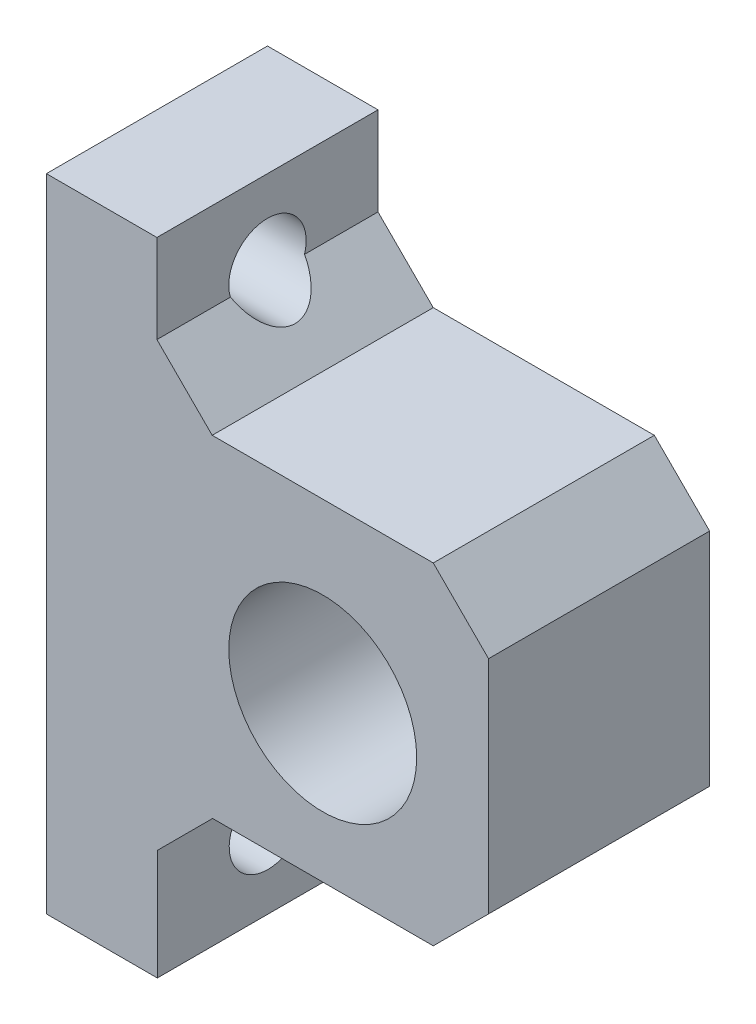
ISO-10303-21;
HEADER;
FILE_DESCRIPTION(('STEP AP214'),'2;1');
FILE_NAME('part.step','',(''),(''),'','','');
FILE_SCHEMA(('AUTOMOTIVE_DESIGN { 1 0 10303 214 1 1 1 1 }'));
ENDSEC;
DATA;
#1=APPLICATION_CONTEXT('core data for automotive mechanical design processes');
#2=APPLICATION_PROTOCOL_DEFINITION('international standard','automotive_design',2000,#1);
#3=PRODUCT_CONTEXT('',#1,'mechanical');
#4=PRODUCT('Part','Part','',(#3));
#5=PRODUCT_RELATED_PRODUCT_CATEGORY('part','',(#4));
#6=PRODUCT_DEFINITION_FORMATION('','',#4);
#7=PRODUCT_DEFINITION_CONTEXT('part definition',#1,'design');
#8=PRODUCT_DEFINITION('design','',#6,#7);
#9=PRODUCT_DEFINITION_SHAPE('','',#8);
#10=(LENGTH_UNIT() NAMED_UNIT(*) SI_UNIT(.MILLI.,.METRE.));
#11=(NAMED_UNIT(*) PLANE_ANGLE_UNIT() SI_UNIT($,.RADIAN.));
#12=(NAMED_UNIT(*) SI_UNIT($,.STERADIAN.) SOLID_ANGLE_UNIT());
#13=UNCERTAINTY_MEASURE_WITH_UNIT(LENGTH_MEASURE(1.E-05),#10,'distance_accuracy_value','');
#14=(GEOMETRIC_REPRESENTATION_CONTEXT(3) GLOBAL_UNCERTAINTY_ASSIGNED_CONTEXT((#13)) GLOBAL_UNIT_ASSIGNED_CONTEXT((#10,
#11,#12)) REPRESENTATION_CONTEXT('',''));
#15=CARTESIAN_POINT('',(0.,0.,0.));
#16=DIRECTION('',(0.,0.,1.));
#17=DIRECTION('',(1.,0.,0.));
#18=AXIS2_PLACEMENT_3D('',#15,#16,#17);
#19=CARTESIAN_POINT('',(0.,0.,20.));
#20=DIRECTION('',(0.,0.,1.));
#21=DIRECTION('',(1.,0.,0.));
#22=AXIS2_PLACEMENT_3D('',#19,#20,#21);
#23=PLANE('',#22);
#24=DIRECTION('',(1.,0.,0.));
#25=VECTOR('',#24,1.);
#26=CARTESIAN_POINT('',(3.69649805447474,-19.4357976653696,20.));
#27=LINE('',#26,#25);
#28=CARTESIAN_POINT('',(8.69649805447477,-19.4357976653696,20.));
#29=VERTEX_POINT('',#28);
#30=CARTESIAN_POINT('',(28.6591974567137,-19.4357976653696,20.));
#31=VERTEX_POINT('',#30);
#32=EDGE_CURVE('E287',#29,#31,#27,.T.);
#33=ORIENTED_EDGE('',*,*,#32,.T.);
#34=DIRECTION('',(-0.707106781186549,-0.707106781186547,0.));
#35=VECTOR('',#34,1.);
#36=CARTESIAN_POINT('',(24.0474975610416,-24.0474975610417,20.));
#37=LINE('',#36,#35);
#38=CARTESIAN_POINT('',(33.6591974567137,-14.4357976653696,20.));
#39=VERTEX_POINT('',#38);
#40=EDGE_CURVE('E186',#31,#39,#37,.F.);
#41=ORIENTED_EDGE('',*,*,#40,.T.);
#42=DIRECTION('',(0.,1.,0.));
#43=VECTOR('',#42,1.);
#44=CARTESIAN_POINT('',(33.6591974567137,10.5642023346304,20.));
#45=LINE('',#44,#43);
#46=CARTESIAN_POINT('',(33.6591974567137,5.56420233463034,20.));
#47=VERTEX_POINT('',#46);
#48=EDGE_CURVE('E235',#39,#47,#45,.T.);
#49=ORIENTED_EDGE('',*,*,#48,.T.);
#50=DIRECTION('',(0.707106781186546,-0.707106781186549,0.));
#51=VECTOR('',#50,1.);
#52=CARTESIAN_POINT('',(19.6116998956721,19.611699895672,20.));
#53=LINE('',#52,#51);
#54=CARTESIAN_POINT('',(28.6591974567137,10.5642023346304,20.));
#55=VERTEX_POINT('',#54);
#56=EDGE_CURVE('E183',#47,#55,#53,.F.);
#57=ORIENTED_EDGE('',*,*,#56,.T.);
#58=DIRECTION('',(-1.,0.,0.));
#59=VECTOR('',#58,1.);
#60=CARTESIAN_POINT('',(3.65919745671372,10.5642023346304,20.));
#61=LINE('',#60,#59);
#62=CARTESIAN_POINT('',(8.65919745671371,10.5642023346304,20.));
#63=VERTEX_POINT('',#62);
#64=EDGE_CURVE('E228',#55,#63,#61,.T.);
#65=ORIENTED_EDGE('',*,*,#64,.T.);
#66=DIRECTION('',(0.707106781186544,-0.707106781186551,0.));
#67=VECTOR('',#66,1.);
#68=CARTESIAN_POINT('',(3.65919745671372,15.5642023346304,20.));
#69=LINE('',#68,#67);
#70=CARTESIAN_POINT('',(3.65919745671372,15.5642023346304,20.));
#71=VERTEX_POINT('',#70);
#72=EDGE_CURVE('E209',#63,#71,#69,.F.);
#73=ORIENTED_EDGE('',*,*,#72,.T.);
#74=DIRECTION('',(0.,1.,0.));
#75=VECTOR('',#74,1.);
#76=CARTESIAN_POINT('',(3.65919745671372,23.5642023346304,20.));
#77=LINE('',#76,#75);
#78=CARTESIAN_POINT('',(3.65919745671372,23.5642023346304,20.));
#79=VERTEX_POINT('',#78);
#80=EDGE_CURVE('E221',#71,#79,#77,.T.);
#81=ORIENTED_EDGE('',*,*,#80,.T.);
#82=DIRECTION('',(-1.,0.,0.));
#83=VECTOR('',#82,1.);
#84=CARTESIAN_POINT('',(-6.34080254328628,23.5642023346304,20.));
#85=LINE('',#84,#83);
#86=CARTESIAN_POINT('',(-6.34080254328628,23.5642023346304,20.));
#87=VERTEX_POINT('',#86);
#88=EDGE_CURVE('E227',#79,#87,#85,.T.);
#89=ORIENTED_EDGE('',*,*,#88,.T.);
#90=DIRECTION('',(0.,-1.,0.));
#91=VECTOR('',#90,1.);
#92=CARTESIAN_POINT('',(-6.34080254328628,23.5642023346304,20.));
#93=LINE('',#92,#91);
#94=CARTESIAN_POINT('',(-6.34080254328628,-34.4357976653696,20.));
#95=VERTEX_POINT('',#94);
#96=EDGE_CURVE('E268',#87,#95,#93,.T.);
#97=ORIENTED_EDGE('',*,*,#96,.T.);
#98=DIRECTION('',(1.,0.,0.));
#99=VECTOR('',#98,1.);
#100=CARTESIAN_POINT('',(-6.34080254328628,-34.4357976653696,20.));
#101=LINE('',#100,#99);
#102=CARTESIAN_POINT('',(3.69649805447474,-34.4357976653696,20.));
#103=VERTEX_POINT('',#102);
#104=EDGE_CURVE('E324',#95,#103,#101,.T.);
#105=ORIENTED_EDGE('',*,*,#104,.T.);
#106=DIRECTION('',(0.,1.,0.));
#107=VECTOR('',#106,1.);
#108=CARTESIAN_POINT('',(3.69649805447474,-34.4357976653696,20.));
#109=LINE('',#108,#107);
#110=CARTESIAN_POINT('',(3.69649805447474,-24.4357976653696,20.));
#111=VERTEX_POINT('',#110);
#112=EDGE_CURVE('E295',#103,#111,#109,.T.);
#113=ORIENTED_EDGE('',*,*,#112,.T.);
#114=DIRECTION('',(-0.707106781186551,-0.707106781186544,0.));
#115=VECTOR('',#114,1.);
#116=CARTESIAN_POINT('',(8.69649805447477,-19.4357976653696,20.));
#117=LINE('',#116,#115);
#118=EDGE_CURVE('E159',#111,#29,#117,.F.);
#119=ORIENTED_EDGE('',*,*,#118,.T.);
#120=EDGE_LOOP('',(#33,#41,#49,#57,#65,#73,#81,#89,#97,#105,#113,#119));
#121=FACE_BOUND('',#120,.T.);
#122=CARTESIAN_POINT('',(18.6591974567137,-5.43579766536964,20.));
#123=DIRECTION('',(0.,0.,1.));
#124=DIRECTION('',(1.,0.,0.));
#125=AXIS2_PLACEMENT_3D('',#122,#123,#124);
#126=CIRCLE('',#125,8.5);
#127=CARTESIAN_POINT('',(27.1591974567137,-5.43579766536964,20.));
#128=VERTEX_POINT('',#127);
#129=EDGE_CURVE('E244',#128,#128,#126,.T.);
#130=ORIENTED_EDGE('',*,*,#129,.F.);
#131=EDGE_LOOP('',(#130));
#132=FACE_BOUND('',#131,.T.);
#133=ADVANCED_FACE('F41',(#121,#132),#23,.T.);
#134=CARTESIAN_POINT('',(0.,0.,0.));
#135=DIRECTION('',(0.,0.,1.));
#136=DIRECTION('',(1.,0.,0.));
#137=AXIS2_PLACEMENT_3D('',#134,#135,#136);
#138=PLANE('',#137);
#139=DIRECTION('',(0.,1.,0.));
#140=VECTOR('',#139,1.);
#141=CARTESIAN_POINT('',(33.6591974567137,10.5642023346304,0.));
#142=LINE('',#141,#140);
#143=CARTESIAN_POINT('',(33.6591974567137,-14.4357976653696,0.));
#144=VERTEX_POINT('',#143);
#145=CARTESIAN_POINT('',(33.6591974567137,5.56420233463034,0.));
#146=VERTEX_POINT('',#145);
#147=EDGE_CURVE('E254',#144,#146,#142,.T.);
#148=ORIENTED_EDGE('',*,*,#147,.F.);
#149=DIRECTION('',(0.707106781186549,0.707106781186547,0.));
#150=VECTOR('',#149,1.);
#151=CARTESIAN_POINT('',(33.6591974567137,-14.4357976653696,0.));
#152=LINE('',#151,#150);
#153=CARTESIAN_POINT('',(28.6591974567137,-19.4357976653696,0.));
#154=VERTEX_POINT('',#153);
#155=EDGE_CURVE('E180',#144,#154,#152,.F.);
#156=ORIENTED_EDGE('',*,*,#155,.T.);
#157=DIRECTION('',(1.,0.,0.));
#158=VECTOR('',#157,1.);
#159=CARTESIAN_POINT('',(3.69649805447474,-19.4357976653696,0.));
#160=LINE('',#159,#158);
#161=CARTESIAN_POINT('',(8.69649805447477,-19.4357976653696,0.));
#162=VERTEX_POINT('',#161);
#163=EDGE_CURVE('E250',#162,#154,#160,.T.);
#164=ORIENTED_EDGE('',*,*,#163,.F.);
#165=DIRECTION('',(0.707106781186551,0.707106781186544,0.));
#166=VECTOR('',#165,1.);
#167=CARTESIAN_POINT('',(14.0661478599222,-14.0661478599223,0.));
#168=LINE('',#167,#166);
#169=CARTESIAN_POINT('',(3.69649805447474,-24.4357976653696,0.));
#170=VERTEX_POINT('',#169);
#171=EDGE_CURVE('E201',#162,#170,#168,.F.);
#172=ORIENTED_EDGE('',*,*,#171,.T.);
#173=DIRECTION('',(0.,1.,0.));
#174=VECTOR('',#173,1.);
#175=CARTESIAN_POINT('',(3.69649805447474,-34.4357976653696,0.));
#176=LINE('',#175,#174);
#177=CARTESIAN_POINT('',(3.69649805447474,-34.4357976653696,0.));
#178=VERTEX_POINT('',#177);
#179=EDGE_CURVE('E247',#178,#170,#176,.T.);
#180=ORIENTED_EDGE('',*,*,#179,.F.);
#181=DIRECTION('',(1.,0.,0.));
#182=VECTOR('',#181,1.);
#183=CARTESIAN_POINT('',(-6.34080254328628,-34.4357976653696,0.));
#184=LINE('',#183,#182);
#185=CARTESIAN_POINT('',(-6.34080254328628,-34.4357976653696,0.));
#186=VERTEX_POINT('',#185);
#187=EDGE_CURVE('E243',#186,#178,#184,.T.);
#188=ORIENTED_EDGE('',*,*,#187,.F.);
#189=DIRECTION('',(0.,-1.,0.));
#190=VECTOR('',#189,1.);
#191=CARTESIAN_POINT('',(-6.34080254328628,23.5642023346304,0.));
#192=LINE('',#191,#190);
#193=CARTESIAN_POINT('',(-6.34080254328628,23.5642023346304,0.));
#194=VERTEX_POINT('',#193);
#195=EDGE_CURVE('E239',#194,#186,#192,.T.);
#196=ORIENTED_EDGE('',*,*,#195,.F.);
#197=DIRECTION('',(-1.,0.,0.));
#198=VECTOR('',#197,1.);
#199=CARTESIAN_POINT('',(-6.34080254328628,23.5642023346304,0.));
#200=LINE('',#199,#198);
#201=CARTESIAN_POINT('',(3.65919745671372,23.5642023346304,0.));
#202=VERTEX_POINT('',#201);
#203=EDGE_CURVE('E265',#202,#194,#200,.T.);
#204=ORIENTED_EDGE('',*,*,#203,.F.);
#205=DIRECTION('',(0.,1.,0.));
#206=VECTOR('',#205,1.);
#207=CARTESIAN_POINT('',(3.65919745671372,23.5642023346304,0.));
#208=LINE('',#207,#206);
#209=CARTESIAN_POINT('',(3.65919745671372,15.5642023346304,0.));
#210=VERTEX_POINT('',#209);
#211=EDGE_CURVE('E262',#210,#202,#208,.T.);
#212=ORIENTED_EDGE('',*,*,#211,.F.);
#213=DIRECTION('',(-0.707106781186544,0.707106781186551,0.));
#214=VECTOR('',#213,1.);
#215=CARTESIAN_POINT('',(9.61169989567208,9.61169989567198,0.));
#216=LINE('',#215,#214);
#217=CARTESIAN_POINT('',(8.65919745671371,10.5642023346304,0.));
#218=VERTEX_POINT('',#217);
#219=EDGE_CURVE('E206',#210,#218,#216,.F.);
#220=ORIENTED_EDGE('',*,*,#219,.T.);
#221=DIRECTION('',(-1.,0.,0.));
#222=VECTOR('',#221,1.);
#223=CARTESIAN_POINT('',(3.65919745671372,10.5642023346304,0.));
#224=LINE('',#223,#222);
#225=CARTESIAN_POINT('',(28.6591974567137,10.5642023346304,0.));
#226=VERTEX_POINT('',#225);
#227=EDGE_CURVE('E258',#226,#218,#224,.T.);
#228=ORIENTED_EDGE('',*,*,#227,.F.);
#229=DIRECTION('',(-0.707106781186546,0.707106781186549,0.));
#230=VECTOR('',#229,1.);
#231=CARTESIAN_POINT('',(28.6591974567137,10.5642023346304,0.));
#232=LINE('',#231,#230);
#233=EDGE_CURVE('E177',#226,#146,#232,.F.);
#234=ORIENTED_EDGE('',*,*,#233,.T.);
#235=EDGE_LOOP('',(#148,#156,#164,#172,#180,#188,#196,#204,#212,#220,#228,#234));
#236=FACE_BOUND('',#235,.T.);
#237=CARTESIAN_POINT('',(18.6591974567137,-5.43579766536964,0.));
#238=DIRECTION('',(0.,0.,1.));
#239=DIRECTION('',(1.,0.,0.));
#240=AXIS2_PLACEMENT_3D('',#237,#238,#239);
#241=CIRCLE('',#240,8.5);
#242=CARTESIAN_POINT('',(27.1591974567137,-5.43579766536964,0.));
#243=VERTEX_POINT('',#242);
#244=EDGE_CURVE('E338',#243,#243,#241,.T.);
#245=ORIENTED_EDGE('',*,*,#244,.T.);
#246=EDGE_LOOP('',(#245));
#247=FACE_BOUND('',#246,.T.);
#248=ADVANCED_FACE('F304',(#236,#247),#138,.F.);
#249=CARTESIAN_POINT('',(-6.34080254328628,23.5642023346304,20.));
#250=DIRECTION('',(1.,0.,0.));
#251=DIRECTION('',(0.,1.,0.));
#252=AXIS2_PLACEMENT_3D('',#249,#250,#251);
#253=PLANE('',#252);
#254=CARTESIAN_POINT('',(-6.34080254328628,-27.4357976653696,10.));
#255=DIRECTION('',(-1.,0.,0.));
#256=DIRECTION('',(0.,-1.,0.));
#257=AXIS2_PLACEMENT_3D('',#254,#255,#256);
#258=CIRCLE('',#257,3.5);
#259=CARTESIAN_POINT('',(-6.34080254328628,-30.9357976653696,10.));
#260=VERTEX_POINT('',#259);
#261=EDGE_CURVE('E154',#260,#260,#258,.T.);
#262=ORIENTED_EDGE('',*,*,#261,.F.);
#263=EDGE_LOOP('',(#262));
#264=FACE_BOUND('',#263,.T.);
#265=CARTESIAN_POINT('',(-6.34080254328628,16.5642023346304,10.));
#266=DIRECTION('',(-1.,0.,0.));
#267=DIRECTION('',(0.,-1.,0.));
#268=AXIS2_PLACEMENT_3D('',#265,#266,#267);
#269=CIRCLE('',#268,3.5);
#270=CARTESIAN_POINT('',(-6.34080254328628,13.0642023346304,10.));
#271=VERTEX_POINT('',#270);
#272=EDGE_CURVE('E153',#271,#271,#269,.T.);
#273=ORIENTED_EDGE('',*,*,#272,.F.);
#274=EDGE_LOOP('',(#273));
#275=FACE_BOUND('',#274,.T.);
#276=ORIENTED_EDGE('',*,*,#195,.T.);
#277=DIRECTION('',(0.,0.,-1.));
#278=VECTOR('',#277,1.);
#279=CARTESIAN_POINT('',(-6.34080254328628,-34.4357976653696,20.));
#280=LINE('',#279,#278);
#281=EDGE_CURVE('E278',#95,#186,#280,.T.);
#282=ORIENTED_EDGE('',*,*,#281,.F.);
#283=ORIENTED_EDGE('',*,*,#96,.F.);
#284=DIRECTION('',(0.,0.,-1.));
#285=VECTOR('',#284,1.);
#286=CARTESIAN_POINT('',(-6.34080254328628,23.5642023346304,20.));
#287=LINE('',#286,#285);
#288=EDGE_CURVE('E232',#87,#194,#287,.T.);
#289=ORIENTED_EDGE('',*,*,#288,.T.);
#290=EDGE_LOOP('',(#276,#282,#283,#289));
#291=FACE_BOUND('',#290,.T.);
#292=ADVANCED_FACE('F329',(#264,#275,#291),#253,.F.);
#293=CARTESIAN_POINT('',(-6.34080254328628,-34.4357976653696,20.));
#294=DIRECTION('',(0.,1.,0.));
#295=DIRECTION('',(0.,0.,1.));
#296=AXIS2_PLACEMENT_3D('',#293,#294,#295);
#297=PLANE('',#296);
#298=ORIENTED_EDGE('',*,*,#187,.T.);
#299=DIRECTION('',(0.,0.,-1.));
#300=VECTOR('',#299,1.);
#301=CARTESIAN_POINT('',(3.69649805447474,-34.4357976653696,20.));
#302=LINE('',#301,#300);
#303=EDGE_CURVE('E274',#103,#178,#302,.T.);
#304=ORIENTED_EDGE('',*,*,#303,.F.);
#305=ORIENTED_EDGE('',*,*,#104,.F.);
#306=ORIENTED_EDGE('',*,*,#281,.T.);
#307=EDGE_LOOP('',(#298,#304,#305,#306));
#308=FACE_BOUND('',#307,.T.);
#309=ADVANCED_FACE('F331',(#308),#297,.F.);
#310=CARTESIAN_POINT('',(3.69649805447474,-34.4357976653696,20.));
#311=DIRECTION('',(-1.,0.,0.));
#312=DIRECTION('',(0.,-1.,0.));
#313=AXIS2_PLACEMENT_3D('',#310,#311,#312);
#314=PLANE('',#313);
#315=DIRECTION('',(0.,0.,1.));
#316=VECTOR('',#315,1.);
#317=CARTESIAN_POINT('',(3.69649805447474,-24.4357976653696,20.));
#318=LINE('',#317,#316);
#319=CARTESIAN_POINT('',(3.69649805447474,-24.4357976653696,8.19722436226802));
#320=VERTEX_POINT('',#319);
#321=EDGE_CURVE('E151',#170,#320,#318,.T.);
#322=ORIENTED_EDGE('',*,*,#321,.T.);
#323=CARTESIAN_POINT('',(3.69649805447474,-27.4357976653696,10.));
#324=DIRECTION('',(-1.,0.,0.));
#325=DIRECTION('',(0.,-1.,0.));
#326=AXIS2_PLACEMENT_3D('',#323,#324,#325);
#327=CIRCLE('',#326,3.5);
#328=CARTESIAN_POINT('',(3.69649805447474,-24.4357976653696,11.802775637732));
#329=VERTEX_POINT('',#328);
#330=EDGE_CURVE('E57',#320,#329,#327,.T.);
#331=ORIENTED_EDGE('',*,*,#330,.T.);
#332=EDGE_CURVE('E148',#329,#111,#318,.T.);
#333=ORIENTED_EDGE('',*,*,#332,.T.);
#334=ORIENTED_EDGE('',*,*,#112,.F.);
#335=ORIENTED_EDGE('',*,*,#303,.T.);
#336=ORIENTED_EDGE('',*,*,#179,.T.);
#337=EDGE_LOOP('',(#322,#331,#333,#334,#335,#336));
#338=FACE_BOUND('',#337,.T.);
#339=ADVANCED_FACE('F146',(#338),#314,.F.);
#340=CARTESIAN_POINT('',(3.69649805447474,-19.4357976653696,20.));
#341=DIRECTION('',(0.,1.,0.));
#342=DIRECTION('',(0.,0.,1.));
#343=AXIS2_PLACEMENT_3D('',#340,#341,#342);
#344=PLANE('',#343);
#345=ORIENTED_EDGE('',*,*,#32,.F.);
#346=DIRECTION('',(0.,0.,-1.));
#347=VECTOR('',#346,1.);
#348=CARTESIAN_POINT('',(8.69649805447477,-19.4357976653696,0.));
#349=LINE('',#348,#347);
#350=EDGE_CURVE('E161',#29,#162,#349,.T.);
#351=ORIENTED_EDGE('',*,*,#350,.T.);
#352=ORIENTED_EDGE('',*,*,#163,.T.);
#353=DIRECTION('',(0.,0.,1.));
#354=VECTOR('',#353,1.);
#355=CARTESIAN_POINT('',(28.6591974567137,-19.4357976653696,20.));
#356=LINE('',#355,#354);
#357=EDGE_CURVE('E167',#154,#31,#356,.T.);
#358=ORIENTED_EDGE('',*,*,#357,.T.);
#359=EDGE_LOOP('',(#345,#351,#352,#358));
#360=FACE_BOUND('',#359,.T.);
#361=ADVANCED_FACE('F286',(#360),#344,.F.);
#362=CARTESIAN_POINT('',(33.6591974567137,10.5642023346304,20.));
#363=DIRECTION('',(-1.,0.,0.));
#364=DIRECTION('',(0.,-1.,0.));
#365=AXIS2_PLACEMENT_3D('',#362,#363,#364);
#366=PLANE('',#365);
#367=ORIENTED_EDGE('',*,*,#48,.F.);
#368=DIRECTION('',(0.,0.,-1.));
#369=VECTOR('',#368,1.);
#370=CARTESIAN_POINT('',(33.6591974567137,-14.4357976653696,20.));
#371=LINE('',#370,#369);
#372=EDGE_CURVE('E173',#39,#144,#371,.T.);
#373=ORIENTED_EDGE('',*,*,#372,.T.);
#374=ORIENTED_EDGE('',*,*,#147,.T.);
#375=DIRECTION('',(0.,0.,1.));
#376=VECTOR('',#375,1.);
#377=CARTESIAN_POINT('',(33.6591974567137,5.56420233463034,20.));
#378=LINE('',#377,#376);
#379=EDGE_CURVE('E165',#146,#47,#378,.T.);
#380=ORIENTED_EDGE('',*,*,#379,.T.);
#381=EDGE_LOOP('',(#367,#373,#374,#380));
#382=FACE_BOUND('',#381,.T.);
#383=ADVANCED_FACE('F301',(#382),#366,.F.);
#384=CARTESIAN_POINT('',(3.65919745671372,10.5642023346304,20.));
#385=DIRECTION('',(0.,-1.,0.));
#386=DIRECTION('',(0.,0.,-1.));
#387=AXIS2_PLACEMENT_3D('',#384,#385,#386);
#388=PLANE('',#387);
#389=ORIENTED_EDGE('',*,*,#64,.F.);
#390=DIRECTION('',(0.,0.,-1.));
#391=VECTOR('',#390,1.);
#392=CARTESIAN_POINT('',(28.6591974567137,10.5642023346304,20.));
#393=LINE('',#392,#391);
#394=EDGE_CURVE('E192',#55,#226,#393,.T.);
#395=ORIENTED_EDGE('',*,*,#394,.T.);
#396=ORIENTED_EDGE('',*,*,#227,.T.);
#397=DIRECTION('',(0.,0.,1.));
#398=VECTOR('',#397,1.);
#399=CARTESIAN_POINT('',(8.65919745671371,10.5642023346304,20.));
#400=LINE('',#399,#398);
#401=EDGE_CURVE('E189',#218,#63,#400,.T.);
#402=ORIENTED_EDGE('',*,*,#401,.T.);
#403=EDGE_LOOP('',(#389,#395,#396,#402));
#404=FACE_BOUND('',#403,.T.);
#405=ADVANCED_FACE('F313',(#404),#388,.F.);
#406=CARTESIAN_POINT('',(3.65919745671372,23.5642023346304,20.));
#407=DIRECTION('',(-1.,0.,0.));
#408=DIRECTION('',(0.,-1.,0.));
#409=AXIS2_PLACEMENT_3D('',#406,#407,#408);
#410=PLANE('',#409);
#411=DIRECTION('',(0.,0.,-1.));
#412=VECTOR('',#411,1.);
#413=CARTESIAN_POINT('',(3.65919745671372,15.5642023346304,0.));
#414=LINE('',#413,#412);
#415=CARTESIAN_POINT('',(3.65919745671372,15.5642023346304,13.3541019662497));
#416=VERTEX_POINT('',#415);
#417=EDGE_CURVE('E197',#71,#416,#414,.T.);
#418=ORIENTED_EDGE('',*,*,#417,.T.);
#419=CARTESIAN_POINT('',(3.65919745671372,16.5642023346304,10.));
#420=DIRECTION('',(-1.,0.,0.));
#421=DIRECTION('',(0.,-1.,0.));
#422=AXIS2_PLACEMENT_3D('',#419,#420,#421);
#423=CIRCLE('',#422,3.5);
#424=CARTESIAN_POINT('',(3.65919745671372,15.5642023346304,6.64589803375031));
#425=VERTEX_POINT('',#424);
#426=EDGE_CURVE('E63',#416,#425,#423,.T.);
#427=ORIENTED_EDGE('',*,*,#426,.T.);
#428=EDGE_CURVE('E196',#425,#210,#414,.T.);
#429=ORIENTED_EDGE('',*,*,#428,.T.);
#430=ORIENTED_EDGE('',*,*,#211,.T.);
#431=DIRECTION('',(0.,0.,-1.));
#432=VECTOR('',#431,1.);
#433=CARTESIAN_POINT('',(3.65919745671372,23.5642023346304,20.));
#434=LINE('',#433,#432);
#435=EDGE_CURVE('E223',#79,#202,#434,.T.);
#436=ORIENTED_EDGE('',*,*,#435,.F.);
#437=ORIENTED_EDGE('',*,*,#80,.F.);
#438=EDGE_LOOP('',(#418,#427,#429,#430,#436,#437));
#439=FACE_BOUND('',#438,.T.);
#440=ADVANCED_FACE('F219',(#439),#410,.F.);
#441=CARTESIAN_POINT('',(-6.34080254328628,23.5642023346304,20.));
#442=DIRECTION('',(0.,-1.,0.));
#443=DIRECTION('',(0.,0.,-1.));
#444=AXIS2_PLACEMENT_3D('',#441,#442,#443);
#445=PLANE('',#444);
#446=ORIENTED_EDGE('',*,*,#203,.T.);
#447=ORIENTED_EDGE('',*,*,#288,.F.);
#448=ORIENTED_EDGE('',*,*,#88,.F.);
#449=ORIENTED_EDGE('',*,*,#435,.T.);
#450=EDGE_LOOP('',(#446,#447,#448,#449));
#451=FACE_BOUND('',#450,.T.);
#452=ADVANCED_FACE('F319',(#451),#445,.F.);
#453=CARTESIAN_POINT('',(18.6591974567137,-5.43579766536964,20.));
#454=DIRECTION('',(0.,0.,-1.));
#455=DIRECTION('',(-1.,0.,0.));
#456=AXIS2_PLACEMENT_3D('',#453,#454,#455);
#457=CYLINDRICAL_SURFACE('',#456,8.5);
#458=ORIENTED_EDGE('',*,*,#129,.T.);
#459=EDGE_LOOP('',(#458));
#460=FACE_BOUND('',#459,.T.);
#461=ORIENTED_EDGE('',*,*,#244,.F.);
#462=EDGE_LOOP('',(#461));
#463=FACE_BOUND('',#462,.T.);
#464=ADVANCED_FACE('F375',(#460,#463),#457,.F.);
#465=CARTESIAN_POINT('',(8.69649805447477,-19.4357976653696,20.));
#466=DIRECTION('',(0.707106781186544,-0.707106781186552,0.));
#467=DIRECTION('',(0.,0.,1.));
#468=AXIS2_PLACEMENT_3D('',#465,#466,#467);
#469=PLANE('',#468);
#470=ORIENTED_EDGE('',*,*,#332,.F.);
#471=CARTESIAN_POINT('',(0.696498054474694,-27.4357976653696,10.));
#472=DIRECTION('',(0.707106781186544,-0.707106781186552,0.));
#473=DIRECTION('',(-0.707106781186551,-0.707106781186544,0.));
#474=AXIS2_PLACEMENT_3D('',#471,#472,#473);
#475=ELLIPSE('',#474,4.94974746830586,3.5);
#476=EDGE_CURVE('E11',#329,#320,#475,.F.);
#477=ORIENTED_EDGE('',*,*,#476,.T.);
#478=ORIENTED_EDGE('',*,*,#321,.F.);
#479=ORIENTED_EDGE('',*,*,#171,.F.);
#480=ORIENTED_EDGE('',*,*,#350,.F.);
#481=ORIENTED_EDGE('',*,*,#118,.F.);
#482=EDGE_LOOP('',(#470,#477,#478,#479,#480,#481));
#483=FACE_BOUND('',#482,.T.);
#484=ADVANCED_FACE('F157',(#483),#469,.T.);
#485=CARTESIAN_POINT('',(33.6591974567137,-14.4357976653696,20.));
#486=DIRECTION('',(-0.707106781186546,0.707106781186548,0.));
#487=DIRECTION('',(0.,0.,-1.));
#488=AXIS2_PLACEMENT_3D('',#485,#486,#487);
#489=PLANE('',#488);
#490=ORIENTED_EDGE('',*,*,#40,.F.);
#491=ORIENTED_EDGE('',*,*,#357,.F.);
#492=ORIENTED_EDGE('',*,*,#155,.F.);
#493=ORIENTED_EDGE('',*,*,#372,.F.);
#494=EDGE_LOOP('',(#490,#491,#492,#493));
#495=FACE_BOUND('',#494,.T.);
#496=ADVANCED_FACE('F298',(#495),#489,.F.);
#497=CARTESIAN_POINT('',(28.6591974567137,10.5642023346304,20.));
#498=DIRECTION('',(-0.707106781186549,-0.707106781186546,0.));
#499=DIRECTION('',(0.,0.,-1.));
#500=AXIS2_PLACEMENT_3D('',#497,#498,#499);
#501=PLANE('',#500);
#502=ORIENTED_EDGE('',*,*,#56,.F.);
#503=ORIENTED_EDGE('',*,*,#379,.F.);
#504=ORIENTED_EDGE('',*,*,#233,.F.);
#505=ORIENTED_EDGE('',*,*,#394,.F.);
#506=EDGE_LOOP('',(#502,#503,#504,#505));
#507=FACE_BOUND('',#506,.T.);
#508=ADVANCED_FACE('F310',(#507),#501,.F.);
#509=CARTESIAN_POINT('',(3.65919745671372,15.5642023346304,20.));
#510=DIRECTION('',(0.707106781186551,0.707106781186544,0.));
#511=DIRECTION('',(0.,0.,1.));
#512=AXIS2_PLACEMENT_3D('',#509,#510,#511);
#513=PLANE('',#512);
#514=ORIENTED_EDGE('',*,*,#428,.F.);
#515=CARTESIAN_POINT('',(2.65919745671376,16.5642023346304,10.));
#516=DIRECTION('',(0.707106781186551,0.707106781186544,0.));
#517=DIRECTION('',(-0.707106781186544,0.707106781186551,0.));
#518=AXIS2_PLACEMENT_3D('',#515,#516,#517);
#519=ELLIPSE('',#518,4.94974746830581,3.5);
#520=EDGE_CURVE('E51',#425,#416,#519,.F.);
#521=ORIENTED_EDGE('',*,*,#520,.T.);
#522=ORIENTED_EDGE('',*,*,#417,.F.);
#523=ORIENTED_EDGE('',*,*,#72,.F.);
#524=ORIENTED_EDGE('',*,*,#401,.F.);
#525=ORIENTED_EDGE('',*,*,#219,.F.);
#526=EDGE_LOOP('',(#514,#521,#522,#523,#524,#525));
#527=FACE_BOUND('',#526,.T.);
#528=ADVANCED_FACE('F44',(#527),#513,.T.);
#529=CARTESIAN_POINT('',(13.6591974567137,16.5642023346304,10.));
#530=DIRECTION('',(-1.,0.,0.));
#531=DIRECTION('',(0.,-1.,0.));
#532=AXIS2_PLACEMENT_3D('',#529,#530,#531);
#533=CYLINDRICAL_SURFACE('',#532,3.5);
#534=ORIENTED_EDGE('',*,*,#272,.T.);
#535=EDGE_LOOP('',(#534));
#536=FACE_BOUND('',#535,.T.);
#537=ORIENTED_EDGE('',*,*,#520,.F.);
#538=ORIENTED_EDGE('',*,*,#426,.F.);
#539=EDGE_LOOP('',(#537,#538));
#540=FACE_BOUND('',#539,.T.);
#541=ADVANCED_FACE('F360',(#536,#540),#533,.F.);
#542=CARTESIAN_POINT('',(13.6591974567137,-27.4357976653696,10.));
#543=DIRECTION('',(-1.,0.,0.));
#544=DIRECTION('',(0.,-1.,0.));
#545=AXIS2_PLACEMENT_3D('',#542,#543,#544);
#546=CYLINDRICAL_SURFACE('',#545,3.5);
#547=ORIENTED_EDGE('',*,*,#261,.T.);
#548=EDGE_LOOP('',(#547));
#549=FACE_BOUND('',#548,.T.);
#550=ORIENTED_EDGE('',*,*,#476,.F.);
#551=ORIENTED_EDGE('',*,*,#330,.F.);
#552=EDGE_LOOP('',(#550,#551));
#553=FACE_BOUND('',#552,.T.);
#554=ADVANCED_FACE('F140',(#549,#553),#546,.F.);
#555=CLOSED_SHELL('',(#133,#248,#292,#309,#339,#361,#383,#405,#440,#452,#464,#484,#496,#508,
#528,#541,#554));
#556=MANIFOLD_SOLID_BREP('B2',#555);
#557=ADVANCED_BREP_SHAPE_REPRESENTATION('',(#18,#556),#14);
#558=SHAPE_DEFINITION_REPRESENTATION(#9,#557);
ENDSEC;
END-ISO-10303-21;
